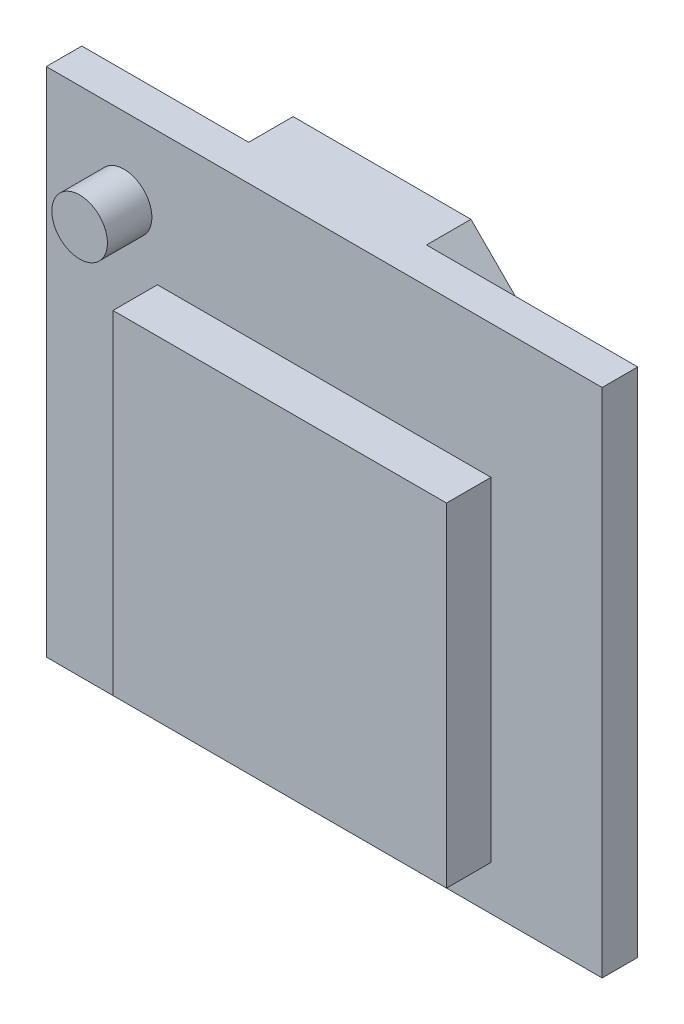
ISO-10303-21;
HEADER;
FILE_DESCRIPTION(('STEP AP214'),'2;1');
FILE_NAME('part.step','',(''),(''),'','','');
FILE_SCHEMA(('AUTOMOTIVE_DESIGN { 1 0 10303 214 1 1 1 1 }'));
ENDSEC;
DATA;
#1=APPLICATION_CONTEXT('core data for automotive mechanical design processes');
#2=APPLICATION_PROTOCOL_DEFINITION('international standard','automotive_design',2000,#1);
#3=PRODUCT_CONTEXT('',#1,'mechanical');
#4=PRODUCT('Part','Part','',(#3));
#5=PRODUCT_RELATED_PRODUCT_CATEGORY('part','',(#4));
#6=PRODUCT_DEFINITION_FORMATION('','',#4);
#7=PRODUCT_DEFINITION_CONTEXT('part definition',#1,'design');
#8=PRODUCT_DEFINITION('design','',#6,#7);
#9=PRODUCT_DEFINITION_SHAPE('','',#8);
#10=(LENGTH_UNIT() NAMED_UNIT(*) SI_UNIT(.MILLI.,.METRE.));
#11=(NAMED_UNIT(*) PLANE_ANGLE_UNIT() SI_UNIT($,.RADIAN.));
#12=(NAMED_UNIT(*) SI_UNIT($,.STERADIAN.) SOLID_ANGLE_UNIT());
#13=UNCERTAINTY_MEASURE_WITH_UNIT(LENGTH_MEASURE(1.E-05),#10,'distance_accuracy_value','');
#14=(GEOMETRIC_REPRESENTATION_CONTEXT(3) GLOBAL_UNCERTAINTY_ASSIGNED_CONTEXT((#13)) GLOBAL_UNIT_ASSIGNED_CONTEXT((#10,
#11,#12)) REPRESENTATION_CONTEXT('',''));
#15=CARTESIAN_POINT('',(0.,0.,0.));
#16=DIRECTION('',(0.,0.,1.));
#17=DIRECTION('',(1.,0.,0.));
#18=AXIS2_PLACEMENT_3D('',#15,#16,#17);
#19=CARTESIAN_POINT('',(0.,0.,1.6));
#20=DIRECTION('',(0.,0.,-1.));
#21=DIRECTION('',(-1.,0.,0.));
#22=AXIS2_PLACEMENT_3D('',#19,#20,#21);
#23=PLANE('',#22);
#24=CARTESIAN_POINT('',(3.5,19.5,1.6));
#25=DIRECTION('',(0.,0.,-1.));
#26=DIRECTION('',(-1.,0.,0.));
#27=AXIS2_PLACEMENT_3D('',#24,#25,#26);
#28=CIRCLE('',#27,1.25);
#29=CARTESIAN_POINT('',(2.25,19.5,1.6));
#30=VERTEX_POINT('',#29);
#31=EDGE_CURVE('E11',#30,#30,#28,.F.);
#32=ORIENTED_EDGE('',*,*,#31,.F.);
#33=EDGE_LOOP('',(#32));
#34=FACE_BOUND('',#33,.T.);
#35=DIRECTION('',(0.,-1.,0.));
#36=VECTOR('',#35,1.);
#37=CARTESIAN_POINT('',(0.,0.,1.6));
#38=LINE('',#37,#36);
#39=CARTESIAN_POINT('',(0.,23.,1.6));
#40=VERTEX_POINT('',#39);
#41=CARTESIAN_POINT('',(0.,0.,1.6));
#42=VERTEX_POINT('',#41);
#43=EDGE_CURVE('E192',#40,#42,#38,.T.);
#44=ORIENTED_EDGE('',*,*,#43,.T.);
#45=DIRECTION('',(1.,0.,0.));
#46=VECTOR('',#45,1.);
#47=CARTESIAN_POINT('',(0.,0.,1.6));
#48=LINE('',#47,#46);
#49=CARTESIAN_POINT('',(25.,0.,1.6));
#50=VERTEX_POINT('',#49);
#51=EDGE_CURVE('E195',#42,#50,#48,.T.);
#52=ORIENTED_EDGE('',*,*,#51,.T.);
#53=DIRECTION('',(0.,1.,0.));
#54=VECTOR('',#53,1.);
#55=CARTESIAN_POINT('',(25.,0.,1.6));
#56=LINE('',#55,#54);
#57=CARTESIAN_POINT('',(25.,23.,1.6));
#58=VERTEX_POINT('',#57);
#59=EDGE_CURVE('E198',#50,#58,#56,.T.);
#60=ORIENTED_EDGE('',*,*,#59,.T.);
#61=DIRECTION('',(-1.,0.,0.));
#62=VECTOR('',#61,1.);
#63=CARTESIAN_POINT('',(0.,23.,1.6));
#64=LINE('',#63,#62);
#65=EDGE_CURVE('E200',#58,#40,#64,.T.);
#66=ORIENTED_EDGE('',*,*,#65,.T.);
#67=EDGE_LOOP('',(#44,#52,#60,#66));
#68=FACE_BOUND('',#67,.T.);
#69=DIRECTION('',(0.,-1.,0.));
#70=VECTOR('',#69,1.);
#71=CARTESIAN_POINT('',(5.,17.,1.6));
#72=LINE('',#71,#70);
#73=CARTESIAN_POINT('',(5.,17.,1.6));
#74=VERTEX_POINT('',#73);
#75=CARTESIAN_POINT('',(5.,2.,1.6));
#76=VERTEX_POINT('',#75);
#77=EDGE_CURVE('E153',#74,#76,#72,.T.);
#78=ORIENTED_EDGE('',*,*,#77,.F.);
#79=DIRECTION('',(-1.,0.,0.));
#80=VECTOR('',#79,1.);
#81=CARTESIAN_POINT('',(5.,17.,1.6));
#82=LINE('',#81,#80);
#83=CARTESIAN_POINT('',(20.,17.,1.6));
#84=VERTEX_POINT('',#83);
#85=EDGE_CURVE('E163',#84,#74,#82,.T.);
#86=ORIENTED_EDGE('',*,*,#85,.F.);
#87=DIRECTION('',(0.,1.,0.));
#88=VECTOR('',#87,1.);
#89=CARTESIAN_POINT('',(20.,17.,1.6));
#90=LINE('',#89,#88);
#91=CARTESIAN_POINT('',(20.,2.,1.6));
#92=VERTEX_POINT('',#91);
#93=EDGE_CURVE('E175',#92,#84,#90,.T.);
#94=ORIENTED_EDGE('',*,*,#93,.F.);
#95=DIRECTION('',(1.,0.,0.));
#96=VECTOR('',#95,1.);
#97=CARTESIAN_POINT('',(5.,2.,1.6));
#98=LINE('',#97,#96);
#99=EDGE_CURVE('E172',#76,#92,#98,.T.);
#100=ORIENTED_EDGE('',*,*,#99,.F.);
#101=EDGE_LOOP('',(#78,#86,#94,#100));
#102=FACE_BOUND('',#101,.T.);
#103=ADVANCED_FACE('F35',(#34,#68,#102),#23,.F.);
#104=CARTESIAN_POINT('',(0.,0.,1.6));
#105=DIRECTION('',(1.,0.,0.));
#106=DIRECTION('',(0.,0.,-1.));
#107=AXIS2_PLACEMENT_3D('',#104,#105,#106);
#108=PLANE('',#107);
#109=DIRECTION('',(0.,-1.,0.));
#110=VECTOR('',#109,1.);
#111=CARTESIAN_POINT('',(0.,0.,0.));
#112=LINE('',#111,#110);
#113=CARTESIAN_POINT('',(0.,23.,0.));
#114=VERTEX_POINT('',#113);
#115=CARTESIAN_POINT('',(0.,0.,0.));
#116=VERTEX_POINT('',#115);
#117=EDGE_CURVE('E191',#114,#116,#112,.T.);
#118=ORIENTED_EDGE('',*,*,#117,.T.);
#119=DIRECTION('',(0.,0.,-1.));
#120=VECTOR('',#119,1.);
#121=CARTESIAN_POINT('',(0.,0.,1.6));
#122=LINE('',#121,#120);
#123=EDGE_CURVE('E43',#42,#116,#122,.T.);
#124=ORIENTED_EDGE('',*,*,#123,.F.);
#125=ORIENTED_EDGE('',*,*,#43,.F.);
#126=DIRECTION('',(0.,0.,-1.));
#127=VECTOR('',#126,1.);
#128=CARTESIAN_POINT('',(0.,23.,1.6));
#129=LINE('',#128,#127);
#130=EDGE_CURVE('E202',#40,#114,#129,.T.);
#131=ORIENTED_EDGE('',*,*,#130,.T.);
#132=EDGE_LOOP('',(#118,#124,#125,#131));
#133=FACE_BOUND('',#132,.T.);
#134=ADVANCED_FACE('F37',(#133),#108,.F.);
#135=CARTESIAN_POINT('',(0.,0.,1.6));
#136=DIRECTION('',(0.,1.,0.));
#137=DIRECTION('',(0.,0.,1.));
#138=AXIS2_PLACEMENT_3D('',#135,#136,#137);
#139=PLANE('',#138);
#140=DIRECTION('',(1.,0.,0.));
#141=VECTOR('',#140,1.);
#142=CARTESIAN_POINT('',(0.,0.,0.));
#143=LINE('',#142,#141);
#144=CARTESIAN_POINT('',(25.,0.,0.));
#145=VERTEX_POINT('',#144);
#146=EDGE_CURVE('E205',#116,#145,#143,.T.);
#147=ORIENTED_EDGE('',*,*,#146,.T.);
#148=DIRECTION('',(0.,0.,-1.));
#149=VECTOR('',#148,1.);
#150=CARTESIAN_POINT('',(25.,0.,1.6));
#151=LINE('',#150,#149);
#152=EDGE_CURVE('E216',#50,#145,#151,.T.);
#153=ORIENTED_EDGE('',*,*,#152,.F.);
#154=ORIENTED_EDGE('',*,*,#51,.F.);
#155=ORIENTED_EDGE('',*,*,#123,.T.);
#156=EDGE_LOOP('',(#147,#153,#154,#155));
#157=FACE_BOUND('',#156,.T.);
#158=ADVANCED_FACE('F221',(#157),#139,.F.);
#159=CARTESIAN_POINT('',(25.,0.,1.6));
#160=DIRECTION('',(-1.,0.,0.));
#161=DIRECTION('',(0.,0.,1.));
#162=AXIS2_PLACEMENT_3D('',#159,#160,#161);
#163=PLANE('',#162);
#164=DIRECTION('',(0.,1.,0.));
#165=VECTOR('',#164,1.);
#166=CARTESIAN_POINT('',(25.,0.,0.));
#167=LINE('',#166,#165);
#168=CARTESIAN_POINT('',(25.,23.,0.));
#169=VERTEX_POINT('',#168);
#170=EDGE_CURVE('E207',#145,#169,#167,.T.);
#171=ORIENTED_EDGE('',*,*,#170,.T.);
#172=DIRECTION('',(0.,0.,-1.));
#173=VECTOR('',#172,1.);
#174=CARTESIAN_POINT('',(25.,23.,1.6));
#175=LINE('',#174,#173);
#176=EDGE_CURVE('E213',#58,#169,#175,.T.);
#177=ORIENTED_EDGE('',*,*,#176,.F.);
#178=ORIENTED_EDGE('',*,*,#59,.F.);
#179=ORIENTED_EDGE('',*,*,#152,.T.);
#180=EDGE_LOOP('',(#171,#177,#178,#179));
#181=FACE_BOUND('',#180,.T.);
#182=ADVANCED_FACE('F232',(#181),#163,.F.);
#183=CARTESIAN_POINT('',(0.,23.,1.6));
#184=DIRECTION('',(0.,-1.,0.));
#185=DIRECTION('',(0.,0.,-1.));
#186=AXIS2_PLACEMENT_3D('',#183,#184,#185);
#187=PLANE('',#186);
#188=DIRECTION('',(-1.,0.,0.));
#189=VECTOR('',#188,1.);
#190=CARTESIAN_POINT('',(0.,23.,0.));
#191=LINE('',#190,#189);
#192=CARTESIAN_POINT('',(15.5,23.,0.));
#193=VERTEX_POINT('',#192);
#194=EDGE_CURVE('E196',#169,#193,#191,.T.);
#195=ORIENTED_EDGE('',*,*,#194,.T.);
#196=DIRECTION('',(0.,0.,1.));
#197=VECTOR('',#196,1.);
#198=CARTESIAN_POINT('',(15.5,23.,-2.));
#199=LINE('',#198,#197);
#200=CARTESIAN_POINT('',(15.5,23.,-2.));
#201=VERTEX_POINT('',#200);
#202=EDGE_CURVE('E135',#201,#193,#199,.T.);
#203=ORIENTED_EDGE('',*,*,#202,.F.);
#204=DIRECTION('',(1.,0.,0.));
#205=VECTOR('',#204,1.);
#206=CARTESIAN_POINT('',(15.5,23.,-2.));
#207=LINE('',#206,#205);
#208=CARTESIAN_POINT('',(7.5,23.,-2.));
#209=VERTEX_POINT('',#208);
#210=EDGE_CURVE('E128',#209,#201,#207,.T.);
#211=ORIENTED_EDGE('',*,*,#210,.F.);
#212=DIRECTION('',(0.,0.,1.));
#213=VECTOR('',#212,1.);
#214=CARTESIAN_POINT('',(7.5,23.,-2.));
#215=LINE('',#214,#213);
#216=CARTESIAN_POINT('',(7.5,23.,0.));
#217=VERTEX_POINT('',#216);
#218=EDGE_CURVE('E133',#209,#217,#215,.T.);
#219=ORIENTED_EDGE('',*,*,#218,.T.);
#220=EDGE_CURVE('E209',#217,#114,#191,.T.);
#221=ORIENTED_EDGE('',*,*,#220,.T.);
#222=ORIENTED_EDGE('',*,*,#130,.F.);
#223=ORIENTED_EDGE('',*,*,#65,.F.);
#224=ORIENTED_EDGE('',*,*,#176,.T.);
#225=EDGE_LOOP('',(#195,#203,#211,#219,#221,#222,#223,#224));
#226=FACE_BOUND('',#225,.T.);
#227=ADVANCED_FACE('F131',(#226),#187,.F.);
#228=CARTESIAN_POINT('',(0.,0.,0.));
#229=DIRECTION('',(0.,0.,-1.));
#230=DIRECTION('',(-1.,0.,0.));
#231=AXIS2_PLACEMENT_3D('',#228,#229,#230);
#232=PLANE('',#231);
#233=DIRECTION('',(0.,1.,0.));
#234=VECTOR('',#233,1.);
#235=CARTESIAN_POINT('',(7.5,23.,0.));
#236=LINE('',#235,#234);
#237=CARTESIAN_POINT('',(7.5,7.,0.));
#238=VERTEX_POINT('',#237);
#239=EDGE_CURVE('E50',#238,#217,#236,.T.);
#240=ORIENTED_EDGE('',*,*,#239,.F.);
#241=DIRECTION('',(-1.,0.,0.));
#242=VECTOR('',#241,1.);
#243=CARTESIAN_POINT('',(17.5,7.,0.));
#244=LINE('',#243,#242);
#245=CARTESIAN_POINT('',(17.5,7.,0.));
#246=VERTEX_POINT('',#245);
#247=EDGE_CURVE('E54',#246,#238,#244,.T.);
#248=ORIENTED_EDGE('',*,*,#247,.F.);
#249=DIRECTION('',(0.,-1.,0.));
#250=VECTOR('',#249,1.);
#251=CARTESIAN_POINT('',(17.5,21.,0.));
#252=LINE('',#251,#250);
#253=CARTESIAN_POINT('',(17.5,21.,0.));
#254=VERTEX_POINT('',#253);
#255=EDGE_CURVE('E403',#254,#246,#252,.T.);
#256=ORIENTED_EDGE('',*,*,#255,.F.);
#257=DIRECTION('',(0.707106781186547,-0.707106781186548,0.));
#258=VECTOR('',#257,1.);
#259=CARTESIAN_POINT('',(17.5,21.,0.));
#260=LINE('',#259,#258);
#261=EDGE_CURVE('E414',#193,#254,#260,.T.);
#262=ORIENTED_EDGE('',*,*,#261,.F.);
#263=ORIENTED_EDGE('',*,*,#194,.F.);
#264=ORIENTED_EDGE('',*,*,#170,.F.);
#265=ORIENTED_EDGE('',*,*,#146,.F.);
#266=ORIENTED_EDGE('',*,*,#117,.F.);
#267=ORIENTED_EDGE('',*,*,#220,.F.);
#268=EDGE_LOOP('',(#240,#248,#256,#262,#263,#264,#265,#266,#267));
#269=FACE_BOUND('',#268,.T.);
#270=ADVANCED_FACE('F227',(#269),#232,.T.);
#271=CARTESIAN_POINT('',(5.,17.,3.6));
#272=DIRECTION('',(1.,0.,0.));
#273=DIRECTION('',(0.,1.,0.));
#274=AXIS2_PLACEMENT_3D('',#271,#272,#273);
#275=PLANE('',#274);
#276=ORIENTED_EDGE('',*,*,#77,.T.);
#277=DIRECTION('',(0.,0.,-1.));
#278=VECTOR('',#277,1.);
#279=CARTESIAN_POINT('',(5.,2.,3.6));
#280=LINE('',#279,#278);
#281=CARTESIAN_POINT('',(5.,2.,3.6));
#282=VERTEX_POINT('',#281);
#283=EDGE_CURVE('E188',#282,#76,#280,.T.);
#284=ORIENTED_EDGE('',*,*,#283,.F.);
#285=DIRECTION('',(0.,-1.,0.));
#286=VECTOR('',#285,1.);
#287=CARTESIAN_POINT('',(5.,17.,3.6));
#288=LINE('',#287,#286);
#289=CARTESIAN_POINT('',(5.,17.,3.6));
#290=VERTEX_POINT('',#289);
#291=EDGE_CURVE('E159',#290,#282,#288,.T.);
#292=ORIENTED_EDGE('',*,*,#291,.F.);
#293=DIRECTION('',(0.,0.,-1.));
#294=VECTOR('',#293,1.);
#295=CARTESIAN_POINT('',(5.,17.,3.6));
#296=LINE('',#295,#294);
#297=EDGE_CURVE('E169',#290,#74,#296,.T.);
#298=ORIENTED_EDGE('',*,*,#297,.T.);
#299=EDGE_LOOP('',(#276,#284,#292,#298));
#300=FACE_BOUND('',#299,.T.);
#301=ADVANCED_FACE('F248',(#300),#275,.F.);
#302=CARTESIAN_POINT('',(5.,2.,3.6));
#303=DIRECTION('',(0.,1.,0.));
#304=DIRECTION('',(0.,0.,1.));
#305=AXIS2_PLACEMENT_3D('',#302,#303,#304);
#306=PLANE('',#305);
#307=ORIENTED_EDGE('',*,*,#99,.T.);
#308=DIRECTION('',(0.,0.,-1.));
#309=VECTOR('',#308,1.);
#310=CARTESIAN_POINT('',(20.,2.,3.6));
#311=LINE('',#310,#309);
#312=CARTESIAN_POINT('',(20.,2.,3.6));
#313=VERTEX_POINT('',#312);
#314=EDGE_CURVE('E185',#313,#92,#311,.T.);
#315=ORIENTED_EDGE('',*,*,#314,.F.);
#316=DIRECTION('',(1.,0.,0.));
#317=VECTOR('',#316,1.);
#318=CARTESIAN_POINT('',(5.,2.,3.6));
#319=LINE('',#318,#317);
#320=EDGE_CURVE('E162',#282,#313,#319,.T.);
#321=ORIENTED_EDGE('',*,*,#320,.F.);
#322=ORIENTED_EDGE('',*,*,#283,.T.);
#323=EDGE_LOOP('',(#307,#315,#321,#322));
#324=FACE_BOUND('',#323,.T.);
#325=ADVANCED_FACE('F256',(#324),#306,.F.);
#326=CARTESIAN_POINT('',(20.,17.,3.6));
#327=DIRECTION('',(-1.,0.,0.));
#328=DIRECTION('',(0.,-1.,0.));
#329=AXIS2_PLACEMENT_3D('',#326,#327,#328);
#330=PLANE('',#329);
#331=ORIENTED_EDGE('',*,*,#93,.T.);
#332=DIRECTION('',(0.,0.,-1.));
#333=VECTOR('',#332,1.);
#334=CARTESIAN_POINT('',(20.,17.,3.6));
#335=LINE('',#334,#333);
#336=CARTESIAN_POINT('',(20.,17.,3.6));
#337=VERTEX_POINT('',#336);
#338=EDGE_CURVE('E182',#337,#84,#335,.T.);
#339=ORIENTED_EDGE('',*,*,#338,.F.);
#340=DIRECTION('',(0.,1.,0.));
#341=VECTOR('',#340,1.);
#342=CARTESIAN_POINT('',(20.,17.,3.6));
#343=LINE('',#342,#341);
#344=EDGE_CURVE('E165',#313,#337,#343,.T.);
#345=ORIENTED_EDGE('',*,*,#344,.F.);
#346=ORIENTED_EDGE('',*,*,#314,.T.);
#347=EDGE_LOOP('',(#331,#339,#345,#346));
#348=FACE_BOUND('',#347,.T.);
#349=ADVANCED_FACE('F254',(#348),#330,.F.);
#350=CARTESIAN_POINT('',(5.,17.,3.6));
#351=DIRECTION('',(0.,-1.,0.));
#352=DIRECTION('',(0.,0.,-1.));
#353=AXIS2_PLACEMENT_3D('',#350,#351,#352);
#354=PLANE('',#353);
#355=ORIENTED_EDGE('',*,*,#85,.T.);
#356=ORIENTED_EDGE('',*,*,#297,.F.);
#357=DIRECTION('',(-1.,0.,0.));
#358=VECTOR('',#357,1.);
#359=CARTESIAN_POINT('',(5.,17.,3.6));
#360=LINE('',#359,#358);
#361=EDGE_CURVE('E167',#337,#290,#360,.T.);
#362=ORIENTED_EDGE('',*,*,#361,.F.);
#363=ORIENTED_EDGE('',*,*,#338,.T.);
#364=EDGE_LOOP('',(#355,#356,#362,#363));
#365=FACE_BOUND('',#364,.T.);
#366=ADVANCED_FACE('F244',(#365),#354,.F.);
#367=CARTESIAN_POINT('',(0.,0.,3.6));
#368=DIRECTION('',(0.,0.,1.));
#369=DIRECTION('',(1.,0.,0.));
#370=AXIS2_PLACEMENT_3D('',#367,#368,#369);
#371=PLANE('',#370);
#372=ORIENTED_EDGE('',*,*,#291,.T.);
#373=ORIENTED_EDGE('',*,*,#320,.T.);
#374=ORIENTED_EDGE('',*,*,#344,.T.);
#375=ORIENTED_EDGE('',*,*,#361,.T.);
#376=EDGE_LOOP('',(#372,#373,#374,#375));
#377=FACE_BOUND('',#376,.T.);
#378=ADVANCED_FACE('F250',(#377),#371,.T.);
#379=CARTESIAN_POINT('',(3.5,19.5,3.6));
#380=DIRECTION('',(0.,0.,-1.));
#381=DIRECTION('',(-1.,0.,0.));
#382=AXIS2_PLACEMENT_3D('',#379,#380,#381);
#383=CYLINDRICAL_SURFACE('',#382,1.25);
#384=CARTESIAN_POINT('',(3.5,19.5,3.6));
#385=DIRECTION('',(0.,0.,1.));
#386=DIRECTION('',(1.,0.,0.));
#387=AXIS2_PLACEMENT_3D('',#384,#385,#386);
#388=CIRCLE('',#387,1.25);
#389=CARTESIAN_POINT('',(4.75,19.5,3.6));
#390=VERTEX_POINT('',#389);
#391=EDGE_CURVE('E150',#390,#390,#388,.T.);
#392=ORIENTED_EDGE('',*,*,#391,.F.);
#393=EDGE_LOOP('',(#392));
#394=FACE_BOUND('',#393,.T.);
#395=ORIENTED_EDGE('',*,*,#31,.T.);
#396=EDGE_LOOP('',(#395));
#397=FACE_BOUND('',#396,.T.);
#398=ADVANCED_FACE('F318',(#394,#397),#383,.T.);
#399=CARTESIAN_POINT('',(3.5,19.5,3.6));
#400=DIRECTION('',(0.,0.,1.));
#401=DIRECTION('',(1.,0.,0.));
#402=AXIS2_PLACEMENT_3D('',#399,#400,#401);
#403=PLANE('',#402);
#404=ORIENTED_EDGE('',*,*,#391,.T.);
#405=EDGE_LOOP('',(#404));
#406=FACE_BOUND('',#405,.T.);
#407=ADVANCED_FACE('F327',(#406),#403,.T.);
#408=CARTESIAN_POINT('',(7.5,23.,-2.));
#409=DIRECTION('',(1.,0.,0.));
#410=DIRECTION('',(0.,0.,-1.));
#411=AXIS2_PLACEMENT_3D('',#408,#409,#410);
#412=PLANE('',#411);
#413=ORIENTED_EDGE('',*,*,#239,.T.);
#414=ORIENTED_EDGE('',*,*,#218,.F.);
#415=DIRECTION('',(0.,1.,0.));
#416=VECTOR('',#415,1.);
#417=CARTESIAN_POINT('',(7.5,23.,-2.));
#418=LINE('',#417,#416);
#419=CARTESIAN_POINT('',(7.5,7.,-2.));
#420=VERTEX_POINT('',#419);
#421=EDGE_CURVE('E139',#420,#209,#418,.T.);
#422=ORIENTED_EDGE('',*,*,#421,.F.);
#423=DIRECTION('',(0.,0.,1.));
#424=VECTOR('',#423,1.);
#425=CARTESIAN_POINT('',(7.5,7.,-2.));
#426=LINE('',#425,#424);
#427=EDGE_CURVE('E400',#420,#238,#426,.T.);
#428=ORIENTED_EDGE('',*,*,#427,.T.);
#429=EDGE_LOOP('',(#413,#414,#422,#428));
#430=FACE_BOUND('',#429,.T.);
#431=ADVANCED_FACE('F149',(#430),#412,.F.);
#432=CARTESIAN_POINT('',(17.5,21.,-2.));
#433=DIRECTION('',(-0.707106781186548,-0.707106781186547,0.));
#434=DIRECTION('',(0.707106781186547,-0.707106781186548,0.));
#435=AXIS2_PLACEMENT_3D('',#432,#433,#434);
#436=PLANE('',#435);
#437=ORIENTED_EDGE('',*,*,#261,.T.);
#438=DIRECTION('',(0.,0.,1.));
#439=VECTOR('',#438,1.);
#440=CARTESIAN_POINT('',(17.5,21.,-2.));
#441=LINE('',#440,#439);
#442=CARTESIAN_POINT('',(17.5,21.,-2.));
#443=VERTEX_POINT('',#442);
#444=EDGE_CURVE('E155',#443,#254,#441,.T.);
#445=ORIENTED_EDGE('',*,*,#444,.F.);
#446=DIRECTION('',(0.707106781186547,-0.707106781186548,0.));
#447=VECTOR('',#446,1.);
#448=CARTESIAN_POINT('',(17.5,21.,-2.));
#449=LINE('',#448,#447);
#450=EDGE_CURVE('E138',#201,#443,#449,.T.);
#451=ORIENTED_EDGE('',*,*,#450,.F.);
#452=ORIENTED_EDGE('',*,*,#202,.T.);
#453=EDGE_LOOP('',(#437,#445,#451,#452));
#454=FACE_BOUND('',#453,.T.);
#455=ADVANCED_FACE('F358',(#454),#436,.F.);
#456=CARTESIAN_POINT('',(17.5,21.,-2.));
#457=DIRECTION('',(-1.,0.,0.));
#458=DIRECTION('',(0.,0.,1.));
#459=AXIS2_PLACEMENT_3D('',#456,#457,#458);
#460=PLANE('',#459);
#461=ORIENTED_EDGE('',*,*,#255,.T.);
#462=DIRECTION('',(0.,0.,1.));
#463=VECTOR('',#462,1.);
#464=CARTESIAN_POINT('',(17.5,7.,-2.));
#465=LINE('',#464,#463);
#466=CARTESIAN_POINT('',(17.5,7.,-2.));
#467=VERTEX_POINT('',#466);
#468=EDGE_CURVE('E402',#467,#246,#465,.T.);
#469=ORIENTED_EDGE('',*,*,#468,.F.);
#470=DIRECTION('',(0.,-1.,0.));
#471=VECTOR('',#470,1.);
#472=CARTESIAN_POINT('',(17.5,21.,-2.));
#473=LINE('',#472,#471);
#474=EDGE_CURVE('E407',#443,#467,#473,.T.);
#475=ORIENTED_EDGE('',*,*,#474,.F.);
#476=ORIENTED_EDGE('',*,*,#444,.T.);
#477=EDGE_LOOP('',(#461,#469,#475,#476));
#478=FACE_BOUND('',#477,.T.);
#479=ADVANCED_FACE('F367',(#478),#460,.F.);
#480=CARTESIAN_POINT('',(17.5,7.,-2.));
#481=DIRECTION('',(0.,1.,0.));
#482=DIRECTION('',(-1.,0.,0.));
#483=AXIS2_PLACEMENT_3D('',#480,#481,#482);
#484=PLANE('',#483);
#485=ORIENTED_EDGE('',*,*,#247,.T.);
#486=ORIENTED_EDGE('',*,*,#427,.F.);
#487=DIRECTION('',(-1.,0.,0.));
#488=VECTOR('',#487,1.);
#489=CARTESIAN_POINT('',(17.5,7.,-2.));
#490=LINE('',#489,#488);
#491=EDGE_CURVE('E144',#467,#420,#490,.T.);
#492=ORIENTED_EDGE('',*,*,#491,.F.);
#493=ORIENTED_EDGE('',*,*,#468,.T.);
#494=EDGE_LOOP('',(#485,#486,#492,#493));
#495=FACE_BOUND('',#494,.T.);
#496=ADVANCED_FACE('F377',(#495),#484,.F.);
#497=CARTESIAN_POINT('',(0.,0.,-2.));
#498=DIRECTION('',(0.,0.,-1.));
#499=DIRECTION('',(-1.,0.,0.));
#500=AXIS2_PLACEMENT_3D('',#497,#498,#499);
#501=PLANE('',#500);
#502=ORIENTED_EDGE('',*,*,#421,.T.);
#503=ORIENTED_EDGE('',*,*,#210,.T.);
#504=ORIENTED_EDGE('',*,*,#450,.T.);
#505=ORIENTED_EDGE('',*,*,#474,.T.);
#506=ORIENTED_EDGE('',*,*,#491,.T.);
#507=EDGE_LOOP('',(#502,#503,#504,#505,#506));
#508=FACE_BOUND('',#507,.T.);
#509=ADVANCED_FACE('F142',(#508),#501,.T.);
#510=CLOSED_SHELL('',(#103,#134,#158,#182,#227,#270,#301,#325,#349,#366,#378,#398,#407,#431,
#455,#479,#496,#509));
#511=MANIFOLD_SOLID_BREP('B2',#510);
#512=ADVANCED_BREP_SHAPE_REPRESENTATION('',(#18,#511),#14);
#513=SHAPE_DEFINITION_REPRESENTATION(#9,#512);
ENDSEC;
END-ISO-10303-21;
